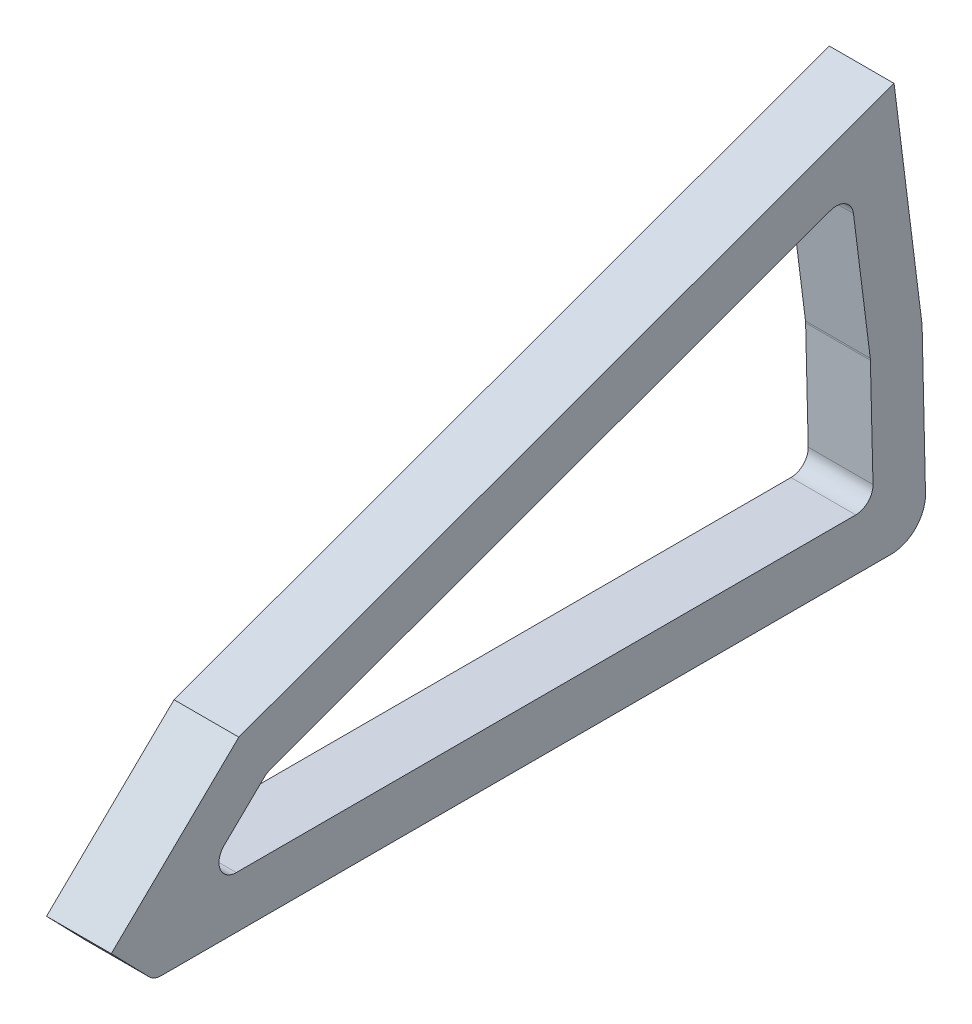
ISO-10303-21;
HEADER;
FILE_DESCRIPTION(('STEP AP214'),'2;1');
FILE_NAME('part.step','',(''),(''),'','','');
FILE_SCHEMA(('AUTOMOTIVE_DESIGN { 1 0 10303 214 1 1 1 1 }'));
ENDSEC;
DATA;
#1=APPLICATION_CONTEXT('core data for automotive mechanical design processes');
#2=APPLICATION_PROTOCOL_DEFINITION('international standard','automotive_design',2000,#1);
#3=PRODUCT_CONTEXT('',#1,'mechanical');
#4=PRODUCT('Part','Part','',(#3));
#5=PRODUCT_RELATED_PRODUCT_CATEGORY('part','',(#4));
#6=PRODUCT_DEFINITION_FORMATION('','',#4);
#7=PRODUCT_DEFINITION_CONTEXT('part definition',#1,'design');
#8=PRODUCT_DEFINITION('design','',#6,#7);
#9=PRODUCT_DEFINITION_SHAPE('','',#8);
#10=(LENGTH_UNIT() NAMED_UNIT(*) SI_UNIT(.MILLI.,.METRE.));
#11=(NAMED_UNIT(*) PLANE_ANGLE_UNIT() SI_UNIT($,.RADIAN.));
#12=(NAMED_UNIT(*) SI_UNIT($,.STERADIAN.) SOLID_ANGLE_UNIT());
#13=UNCERTAINTY_MEASURE_WITH_UNIT(LENGTH_MEASURE(1.E-05),#10,'distance_accuracy_value','');
#14=(GEOMETRIC_REPRESENTATION_CONTEXT(3) GLOBAL_UNCERTAINTY_ASSIGNED_CONTEXT((#13)) GLOBAL_UNIT_ASSIGNED_CONTEXT((#10,
#11,#12)) REPRESENTATION_CONTEXT('',''));
#15=CARTESIAN_POINT('',(0.,0.,0.));
#16=DIRECTION('',(0.,0.,1.));
#17=DIRECTION('',(1.,0.,0.));
#18=AXIS2_PLACEMENT_3D('',#15,#16,#17);
#19=CARTESIAN_POINT('',(15.,-10.8584886774871,98.699643505515));
#20=DIRECTION('',(1.,0.,0.));
#21=DIRECTION('',(0.,0.,-1.));
#22=AXIS2_PLACEMENT_3D('',#19,#20,#21);
#23=PLANE('',#22);
#24=DIRECTION('',(0.,-0.696465559145117,0.717590220756024));
#25=VECTOR('',#24,1.);
#26=CARTESIAN_POINT('',(15.,24.0120476827421,80.7643565809834));
#27=LINE('',#26,#25);
#28=CARTESIAN_POINT('',(15.,24.0120476827421,80.7643565809834));
#29=VERTEX_POINT('',#28);
#30=CARTESIAN_POINT('',(15.,-4.65190763436072,110.297725106755));
#31=VERTEX_POINT('',#30);
#32=EDGE_CURVE('E239',#29,#31,#27,.T.);
#33=ORIENTED_EDGE('',*,*,#32,.T.);
#34=DIRECTION('',(0.,-0.717590220756024,-0.696465559145117));
#35=VECTOR('',#34,1.);
#36=CARTESIAN_POINT('',(15.,-4.65190763436072,110.297725106755));
#37=LINE('',#36,#35);
#38=CARTESIAN_POINT('',(15.,-13.6443509140675,101.570004388539));
#39=VERTEX_POINT('',#38);
#40=EDGE_CURVE('E242',#31,#39,#37,.T.);
#41=ORIENTED_EDGE('',*,*,#40,.T.);
#42=CARTESIAN_POINT('',(15.,-10.8584886774871,98.699643505515));
#43=DIRECTION('',(1.,0.,0.));
#44=DIRECTION('',(0.,0.,-1.));
#45=AXIS2_PLACEMENT_3D('',#42,#43,#44);
#46=CIRCLE('',#45,4.);
#47=CARTESIAN_POINT('',(15.,-14.8584886774871,98.699643505515));
#48=VERTEX_POINT('',#47);
#49=EDGE_CURVE('E245',#39,#48,#46,.T.);
#50=ORIENTED_EDGE('',*,*,#49,.T.);
#51=DIRECTION('',(0.,0.,-1.));
#52=VECTOR('',#51,1.);
#53=CARTESIAN_POINT('',(15.,-14.8584886774871,-70.2619743209976));
#54=LINE('',#53,#52);
#55=CARTESIAN_POINT('',(15.,-14.8584886774871,-70.2619743209976));
#56=VERTEX_POINT('',#55);
#57=EDGE_CURVE('E247',#48,#56,#54,.T.);
#58=ORIENTED_EDGE('',*,*,#57,.T.);
#59=CARTESIAN_POINT('',(15.,-6.85848867748714,-70.2619743209977));
#60=DIRECTION('',(1.,0.,0.));
#61=DIRECTION('',(0.,0.,1.));
#62=AXIS2_PLACEMENT_3D('',#59,#60,#61);
#63=CIRCLE('',#62,8.);
#64=CARTESIAN_POINT('',(15.,-6.67527630251636,-78.2598761224489));
#65=VERTEX_POINT('',#64);
#66=EDGE_CURVE('E249',#56,#65,#63,.T.);
#67=ORIENTED_EDGE('',*,*,#66,.T.);
#68=DIRECTION('',(0.,0.99973772518141,0.0229015468713474));
#69=VECTOR('',#68,1.);
#70=CARTESIAN_POINT('',(15.,27.5551896385567,-77.475739843071));
#71=LINE('',#70,#69);
#72=CARTESIAN_POINT('',(15.,27.5551896385567,-77.475739843071));
#73=VERTEX_POINT('',#72);
#74=EDGE_CURVE('E251',#65,#73,#71,.T.);
#75=ORIENTED_EDGE('',*,*,#74,.T.);
#76=DIRECTION('',(0.,0.992208417106749,0.124589152908747));
#77=VECTOR('',#76,1.);
#78=CARTESIAN_POINT('',(15.,79.2443893893612,-70.9852550815505));
#79=LINE('',#78,#77);
#80=CARTESIAN_POINT('',(15.,79.2443893893612,-70.9852550815505));
#81=VERTEX_POINT('',#80);
#82=EDGE_CURVE('E253',#73,#81,#79,.T.);
#83=ORIENTED_EDGE('',*,*,#82,.T.);
#84=DIRECTION('',(0.,-0.342020143325676,0.939692620785906));
#85=VECTOR('',#84,1.);
#86=CARTESIAN_POINT('',(15.,24.0120476827421,80.7643565809834));
#87=LINE('',#86,#85);
#88=EDGE_CURVE('E255',#81,#29,#87,.T.);
#89=ORIENTED_EDGE('',*,*,#88,.T.);
#90=EDGE_LOOP('',(#33,#41,#50,#58,#67,#75,#83,#89));
#91=FACE_BOUND('',#90,.T.);
#92=DIRECTION('',(0.,-0.696465559145117,0.717590220756024));
#93=VECTOR('',#92,1.);
#94=CARTESIAN_POINT('',(15.,13.0176999105198,74.862322372561));
#95=LINE('',#94,#93);
#96=CARTESIAN_POINT('',(15.,13.0176999105198,74.862322372561));
#97=VERTEX_POINT('',#96);
#98=CARTESIAN_POINT('',(15.,4.01187220553716,84.141307967831));
#99=VERTEX_POINT('',#98);
#100=EDGE_CURVE('E168',#97,#99,#95,.T.);
#101=ORIENTED_EDGE('',*,*,#100,.F.);
#102=CARTESIAN_POINT('',(15.,10.1473390274957,72.0764601359805));
#103=DIRECTION('',(1.,0.,0.));
#104=DIRECTION('',(0.,0.,-1.));
#105=AXIS2_PLACEMENT_3D('',#102,#103,#104);
#106=CIRCLE('',#105,4.);
#107=CARTESIAN_POINT('',(15.,13.9061095106393,73.4445407092832));
#108=VERTEX_POINT('',#107);
#109=EDGE_CURVE('E160',#108,#97,#106,.T.);
#110=ORIENTED_EDGE('',*,*,#109,.F.);
#111=DIRECTION('',(0.,-0.342020143325677,0.939692620785906));
#112=VECTOR('',#111,1.);
#113=CARTESIAN_POINT('',(15.,13.9061095106393,73.4445407092832));
#114=LINE('',#113,#112);
#115=CARTESIAN_POINT('',(15.,61.1077436976681,-56.2408833809324));
#116=VERTEX_POINT('',#115);
#117=EDGE_CURVE('E197',#116,#108,#114,.T.);
#118=ORIENTED_EDGE('',*,*,#117,.F.);
#119=CARTESIAN_POINT('',(15.,57.3489732145245,-57.6089639542351));
#120=DIRECTION('',(1.,0.,0.));
#121=DIRECTION('',(0.,0.,1.));
#122=AXIS2_PLACEMENT_3D('',#119,#120,#121);
#123=CIRCLE('',#122,4.);
#124=CARTESIAN_POINT('',(15.,57.8473298261595,-61.5777976226621));
#125=VERTEX_POINT('',#124);
#126=EDGE_CURVE('E195',#125,#116,#123,.T.);
#127=ORIENTED_EDGE('',*,*,#126,.F.);
#128=DIRECTION('',(0.,0.992208417106749,0.124589152908746));
#129=VECTOR('',#128,1.);
#130=CARTESIAN_POINT('',(15.,57.8473298261595,-61.5777976226621));
#131=LINE('',#130,#129);
#132=CARTESIAN_POINT('',(15.,26.8615184457951,-65.4686091956247));
#133=VERTEX_POINT('',#132);
#134=EDGE_CURVE('E193',#133,#125,#131,.T.);
#135=ORIENTED_EDGE('',*,*,#134,.F.);
#136=CARTESIAN_POINT('',(15.,26.3631618341601,-61.4997755271977));
#137=DIRECTION('',(1.,0.,0.));
#138=DIRECTION('',(0.,0.,-1.));
#139=AXIS2_PLACEMENT_3D('',#136,#137,#138);
#140=CIRCLE('',#139,3.99999999999999);
#141=CARTESIAN_POINT('',(15.,26.4593041600422,-65.4986199419222));
#142=VERTEX_POINT('',#141);
#143=EDGE_CURVE('E191',#142,#133,#140,.T.);
#144=ORIENTED_EDGE('',*,*,#143,.F.);
#145=DIRECTION('',(0.,0.999711103681145,0.0240355814705314));
#146=VECTOR('',#145,1.);
#147=CARTESIAN_POINT('',(15.,1.23765364839515,-66.1050121620964));
#148=LINE('',#147,#146);
#149=CARTESIAN_POINT('',(15.,1.23765364839515,-66.1050121620964));
#150=VERTEX_POINT('',#149);
#151=EDGE_CURVE('E189',#150,#142,#148,.T.);
#152=ORIENTED_EDGE('',*,*,#151,.F.);
#153=CARTESIAN_POINT('',(15.,1.141511322513,-62.1061677473718));
#154=DIRECTION('',(1.,0.,0.));
#155=DIRECTION('',(0.,0.,-1.));
#156=AXIS2_PLACEMENT_3D('',#153,#154,#155);
#157=CIRCLE('',#156,4.);
#158=CARTESIAN_POINT('',(15.,-2.858488677487,-62.1061677473718));
#159=VERTEX_POINT('',#158);
#160=EDGE_CURVE('E187',#159,#150,#157,.T.);
#161=ORIENTED_EDGE('',*,*,#160,.F.);
#162=DIRECTION('',(0.,0.,-1.));
#163=VECTOR('',#162,1.);
#164=CARTESIAN_POINT('',(15.,-2.858488677487,-62.1061677473718));
#165=LINE('',#164,#163);
#166=CARTESIAN_POINT('',(15.,-2.85848867748701,81.3554457312505));
#167=VERTEX_POINT('',#166);
#168=EDGE_CURVE('E183',#167,#159,#165,.T.);
#169=ORIENTED_EDGE('',*,*,#168,.F.);
#170=CARTESIAN_POINT('',(15.,1.14151132251299,81.3554457312506));
#171=DIRECTION('',(1.,0.,0.));
#172=DIRECTION('',(0.,0.,1.));
#173=AXIS2_PLACEMENT_3D('',#170,#171,#172);
#174=CIRCLE('',#173,4.);
#175=EDGE_CURVE('E181',#99,#167,#174,.T.);
#176=ORIENTED_EDGE('',*,*,#175,.F.);
#177=EDGE_LOOP('',(#101,#110,#118,#127,#135,#144,#152,#161,#169,#176));
#178=FACE_BOUND('',#177,.T.);
#179=ADVANCED_FACE('F35',(#91,#178),#23,.T.);
#180=CARTESIAN_POINT('',(0.,-10.8584886774871,98.699643505515));
#181=DIRECTION('',(1.,0.,0.));
#182=DIRECTION('',(0.,0.,-1.));
#183=AXIS2_PLACEMENT_3D('',#180,#181,#182);
#184=PLANE('',#183);
#185=DIRECTION('',(0.,-0.696465559145117,0.717590220756024));
#186=VECTOR('',#185,1.);
#187=CARTESIAN_POINT('',(0.,24.0120476827421,80.7643565809834));
#188=LINE('',#187,#186);
#189=CARTESIAN_POINT('',(0.,24.0120476827421,80.7643565809834));
#190=VERTEX_POINT('',#189);
#191=CARTESIAN_POINT('',(0.,-4.65190763436072,110.297725106755));
#192=VERTEX_POINT('',#191);
#193=EDGE_CURVE('E176',#190,#192,#188,.T.);
#194=ORIENTED_EDGE('',*,*,#193,.F.);
#195=DIRECTION('',(0.,-0.342020143325676,0.939692620785906));
#196=VECTOR('',#195,1.);
#197=CARTESIAN_POINT('',(0.,24.0120476827421,80.7643565809834));
#198=LINE('',#197,#196);
#199=CARTESIAN_POINT('',(0.,79.2443893893612,-70.9852550815505));
#200=VERTEX_POINT('',#199);
#201=EDGE_CURVE('E243',#200,#190,#198,.T.);
#202=ORIENTED_EDGE('',*,*,#201,.F.);
#203=DIRECTION('',(0.,0.992208417106749,0.124589152908747));
#204=VECTOR('',#203,1.);
#205=CARTESIAN_POINT('',(0.,79.2443893893612,-70.9852550815505));
#206=LINE('',#205,#204);
#207=CARTESIAN_POINT('',(0.,27.5551896385567,-77.475739843071));
#208=VERTEX_POINT('',#207);
#209=EDGE_CURVE('E270',#208,#200,#206,.T.);
#210=ORIENTED_EDGE('',*,*,#209,.F.);
#211=DIRECTION('',(0.,0.99973772518141,0.0229015468713474));
#212=VECTOR('',#211,1.);
#213=CARTESIAN_POINT('',(0.,27.5551896385567,-77.475739843071));
#214=LINE('',#213,#212);
#215=CARTESIAN_POINT('',(0.,-6.67527630251636,-78.2598761224489));
#216=VERTEX_POINT('',#215);
#217=EDGE_CURVE('E268',#216,#208,#214,.T.);
#218=ORIENTED_EDGE('',*,*,#217,.F.);
#219=CARTESIAN_POINT('',(0.,-6.85848867748714,-70.2619743209977));
#220=DIRECTION('',(1.,0.,0.));
#221=DIRECTION('',(0.,0.,1.));
#222=AXIS2_PLACEMENT_3D('',#219,#220,#221);
#223=CIRCLE('',#222,8.);
#224=CARTESIAN_POINT('',(0.,-14.8584886774871,-70.2619743209976));
#225=VERTEX_POINT('',#224);
#226=EDGE_CURVE('E266',#225,#216,#223,.T.);
#227=ORIENTED_EDGE('',*,*,#226,.F.);
#228=DIRECTION('',(0.,0.,-1.));
#229=VECTOR('',#228,1.);
#230=CARTESIAN_POINT('',(0.,-14.8584886774871,-70.2619743209976));
#231=LINE('',#230,#229);
#232=CARTESIAN_POINT('',(0.,-14.8584886774871,98.699643505515));
#233=VERTEX_POINT('',#232);
#234=EDGE_CURVE('E264',#233,#225,#231,.T.);
#235=ORIENTED_EDGE('',*,*,#234,.F.);
#236=CARTESIAN_POINT('',(0.,-10.8584886774871,98.699643505515));
#237=DIRECTION('',(1.,0.,0.));
#238=DIRECTION('',(0.,0.,-1.));
#239=AXIS2_PLACEMENT_3D('',#236,#237,#238);
#240=CIRCLE('',#239,4.);
#241=CARTESIAN_POINT('',(0.,-13.6443509140675,101.570004388539));
#242=VERTEX_POINT('',#241);
#243=EDGE_CURVE('E262',#242,#233,#240,.T.);
#244=ORIENTED_EDGE('',*,*,#243,.F.);
#245=DIRECTION('',(0.,-0.717590220756024,-0.696465559145117));
#246=VECTOR('',#245,1.);
#247=CARTESIAN_POINT('',(0.,-4.65190763436072,110.297725106755));
#248=LINE('',#247,#246);
#249=EDGE_CURVE('E260',#192,#242,#248,.T.);
#250=ORIENTED_EDGE('',*,*,#249,.F.);
#251=EDGE_LOOP('',(#194,#202,#210,#218,#227,#235,#244,#250));
#252=FACE_BOUND('',#251,.T.);
#253=CARTESIAN_POINT('',(0.,10.1473390274957,72.0764601359805));
#254=DIRECTION('',(1.,0.,0.));
#255=DIRECTION('',(0.,0.,-1.));
#256=AXIS2_PLACEMENT_3D('',#253,#254,#255);
#257=CIRCLE('',#256,4.);
#258=CARTESIAN_POINT('',(0.,13.9061095106393,73.4445407092832));
#259=VERTEX_POINT('',#258);
#260=CARTESIAN_POINT('',(0.,13.0176999105198,74.862322372561));
#261=VERTEX_POINT('',#260);
#262=EDGE_CURVE('E58',#259,#261,#257,.T.);
#263=ORIENTED_EDGE('',*,*,#262,.T.);
#264=DIRECTION('',(0.,-0.696465559145117,0.717590220756024));
#265=VECTOR('',#264,1.);
#266=CARTESIAN_POINT('',(0.,13.0176999105198,74.862322372561));
#267=LINE('',#266,#265);
#268=CARTESIAN_POINT('',(0.,4.01187220553716,84.141307967831));
#269=VERTEX_POINT('',#268);
#270=EDGE_CURVE('E175',#261,#269,#267,.T.);
#271=ORIENTED_EDGE('',*,*,#270,.T.);
#272=CARTESIAN_POINT('',(0.,1.14151132251299,81.3554457312506));
#273=DIRECTION('',(1.,0.,0.));
#274=DIRECTION('',(0.,0.,1.));
#275=AXIS2_PLACEMENT_3D('',#272,#273,#274);
#276=CIRCLE('',#275,4.);
#277=CARTESIAN_POINT('',(0.,-2.85848867748701,81.3554457312505));
#278=VERTEX_POINT('',#277);
#279=EDGE_CURVE('E201',#269,#278,#276,.T.);
#280=ORIENTED_EDGE('',*,*,#279,.T.);
#281=DIRECTION('',(0.,0.,-1.));
#282=VECTOR('',#281,1.);
#283=CARTESIAN_POINT('',(0.,-2.858488677487,-62.1061677473718));
#284=LINE('',#283,#282);
#285=CARTESIAN_POINT('',(0.,-2.858488677487,-62.1061677473718));
#286=VERTEX_POINT('',#285);
#287=EDGE_CURVE('E204',#278,#286,#284,.T.);
#288=ORIENTED_EDGE('',*,*,#287,.T.);
#289=CARTESIAN_POINT('',(0.,1.141511322513,-62.1061677473718));
#290=DIRECTION('',(1.,0.,0.));
#291=DIRECTION('',(0.,0.,-1.));
#292=AXIS2_PLACEMENT_3D('',#289,#290,#291);
#293=CIRCLE('',#292,4.);
#294=CARTESIAN_POINT('',(0.,1.23765364839515,-66.1050121620964));
#295=VERTEX_POINT('',#294);
#296=EDGE_CURVE('E207',#286,#295,#293,.T.);
#297=ORIENTED_EDGE('',*,*,#296,.T.);
#298=DIRECTION('',(0.,0.999711103681145,0.0240355814705314));
#299=VECTOR('',#298,1.);
#300=CARTESIAN_POINT('',(0.,1.23765364839515,-66.1050121620964));
#301=LINE('',#300,#299);
#302=CARTESIAN_POINT('',(0.,26.4593041600422,-65.4986199419222));
#303=VERTEX_POINT('',#302);
#304=EDGE_CURVE('E210',#295,#303,#301,.T.);
#305=ORIENTED_EDGE('',*,*,#304,.T.);
#306=CARTESIAN_POINT('',(0.,26.3631618341601,-61.4997755271977));
#307=DIRECTION('',(1.,0.,0.));
#308=DIRECTION('',(0.,0.,-1.));
#309=AXIS2_PLACEMENT_3D('',#306,#307,#308);
#310=CIRCLE('',#309,3.99999999999999);
#311=CARTESIAN_POINT('',(0.,26.8615184457951,-65.4686091956247));
#312=VERTEX_POINT('',#311);
#313=EDGE_CURVE('E213',#303,#312,#310,.T.);
#314=ORIENTED_EDGE('',*,*,#313,.T.);
#315=DIRECTION('',(0.,0.992208417106749,0.124589152908746));
#316=VECTOR('',#315,1.);
#317=CARTESIAN_POINT('',(0.,57.8473298261595,-61.5777976226621));
#318=LINE('',#317,#316);
#319=CARTESIAN_POINT('',(0.,57.8473298261595,-61.5777976226621));
#320=VERTEX_POINT('',#319);
#321=EDGE_CURVE('E216',#312,#320,#318,.T.);
#322=ORIENTED_EDGE('',*,*,#321,.T.);
#323=CARTESIAN_POINT('',(0.,57.3489732145245,-57.6089639542351));
#324=DIRECTION('',(1.,0.,0.));
#325=DIRECTION('',(0.,0.,1.));
#326=AXIS2_PLACEMENT_3D('',#323,#324,#325);
#327=CIRCLE('',#326,4.);
#328=CARTESIAN_POINT('',(0.,61.1077436976681,-56.2408833809324));
#329=VERTEX_POINT('',#328);
#330=EDGE_CURVE('E219',#320,#329,#327,.T.);
#331=ORIENTED_EDGE('',*,*,#330,.T.);
#332=DIRECTION('',(0.,-0.342020143325677,0.939692620785906));
#333=VECTOR('',#332,1.);
#334=CARTESIAN_POINT('',(0.,13.9061095106393,73.4445407092832));
#335=LINE('',#334,#333);
#336=EDGE_CURVE('E169',#329,#259,#335,.T.);
#337=ORIENTED_EDGE('',*,*,#336,.T.);
#338=EDGE_LOOP('',(#263,#271,#280,#288,#297,#305,#314,#322,#331,#337));
#339=FACE_BOUND('',#338,.T.);
#340=ADVANCED_FACE('F300',(#252,#339),#184,.F.);
#341=CARTESIAN_POINT('',(15.,24.0120476827421,80.7643565809834));
#342=DIRECTION('',(0.,-0.717590220756024,-0.696465559145117));
#343=DIRECTION('',(0.,0.696465559145117,-0.717590220756024));
#344=AXIS2_PLACEMENT_3D('',#341,#342,#343);
#345=PLANE('',#344);
#346=ORIENTED_EDGE('',*,*,#193,.T.);
#347=DIRECTION('',(-1.,0.,0.));
#348=VECTOR('',#347,1.);
#349=CARTESIAN_POINT('',(15.,-4.65190763436072,110.297725106755));
#350=LINE('',#349,#348);
#351=EDGE_CURVE('E11',#31,#192,#350,.T.);
#352=ORIENTED_EDGE('',*,*,#351,.F.);
#353=ORIENTED_EDGE('',*,*,#32,.F.);
#354=DIRECTION('',(-1.,0.,0.));
#355=VECTOR('',#354,1.);
#356=CARTESIAN_POINT('',(15.,24.0120476827421,80.7643565809834));
#357=LINE('',#356,#355);
#358=EDGE_CURVE('E257',#29,#190,#357,.T.);
#359=ORIENTED_EDGE('',*,*,#358,.T.);
#360=EDGE_LOOP('',(#346,#352,#353,#359));
#361=FACE_BOUND('',#360,.T.);
#362=ADVANCED_FACE('F37',(#361),#345,.F.);
#363=CARTESIAN_POINT('',(15.,-4.65190763436072,110.297725106755));
#364=DIRECTION('',(0.,0.696465559145117,-0.717590220756024));
#365=DIRECTION('',(0.,0.717590220756024,0.696465559145117));
#366=AXIS2_PLACEMENT_3D('',#363,#364,#365);
#367=PLANE('',#366);
#368=ORIENTED_EDGE('',*,*,#249,.T.);
#369=DIRECTION('',(-1.,0.,0.));
#370=VECTOR('',#369,1.);
#371=CARTESIAN_POINT('',(15.,-13.6443509140675,101.570004388539));
#372=LINE('',#371,#370);
#373=EDGE_CURVE('E43',#39,#242,#372,.T.);
#374=ORIENTED_EDGE('',*,*,#373,.F.);
#375=ORIENTED_EDGE('',*,*,#40,.F.);
#376=ORIENTED_EDGE('',*,*,#351,.T.);
#377=EDGE_LOOP('',(#368,#374,#375,#376));
#378=FACE_BOUND('',#377,.T.);
#379=ADVANCED_FACE('F317',(#378),#367,.F.);
#380=CARTESIAN_POINT('',(15.,-10.8584886774871,98.699643505515));
#381=DIRECTION('',(-1.,0.,0.));
#382=DIRECTION('',(0.,0.,1.));
#383=AXIS2_PLACEMENT_3D('',#380,#381,#382);
#384=CYLINDRICAL_SURFACE('',#383,4.);
#385=ORIENTED_EDGE('',*,*,#243,.T.);
#386=DIRECTION('',(-1.,0.,0.));
#387=VECTOR('',#386,1.);
#388=CARTESIAN_POINT('',(15.,-14.8584886774871,98.699643505515));
#389=LINE('',#388,#387);
#390=EDGE_CURVE('E287',#48,#233,#389,.T.);
#391=ORIENTED_EDGE('',*,*,#390,.F.);
#392=ORIENTED_EDGE('',*,*,#49,.F.);
#393=ORIENTED_EDGE('',*,*,#373,.T.);
#394=EDGE_LOOP('',(#385,#391,#392,#393));
#395=FACE_BOUND('',#394,.T.);
#396=ADVANCED_FACE('F294',(#395),#384,.T.);
#397=CARTESIAN_POINT('',(15.,-14.8584886774871,-70.2619743209976));
#398=DIRECTION('',(0.,1.,0.));
#399=DIRECTION('',(0.,0.,1.));
#400=AXIS2_PLACEMENT_3D('',#397,#398,#399);
#401=PLANE('',#400);
#402=ORIENTED_EDGE('',*,*,#234,.T.);
#403=DIRECTION('',(-1.,0.,0.));
#404=VECTOR('',#403,1.);
#405=CARTESIAN_POINT('',(15.,-14.8584886774871,-70.2619743209976));
#406=LINE('',#405,#404);
#407=EDGE_CURVE('E284',#56,#225,#406,.T.);
#408=ORIENTED_EDGE('',*,*,#407,.F.);
#409=ORIENTED_EDGE('',*,*,#57,.F.);
#410=ORIENTED_EDGE('',*,*,#390,.T.);
#411=EDGE_LOOP('',(#402,#408,#409,#410));
#412=FACE_BOUND('',#411,.T.);
#413=ADVANCED_FACE('F306',(#412),#401,.F.);
#414=CARTESIAN_POINT('',(15.,-6.85848867748714,-70.2619743209977));
#415=DIRECTION('',(-1.,0.,0.));
#416=DIRECTION('',(0.,0.,1.));
#417=AXIS2_PLACEMENT_3D('',#414,#415,#416);
#418=CYLINDRICAL_SURFACE('',#417,8.);
#419=ORIENTED_EDGE('',*,*,#226,.T.);
#420=DIRECTION('',(-1.,0.,0.));
#421=VECTOR('',#420,1.);
#422=CARTESIAN_POINT('',(15.,-6.67527630251636,-78.2598761224489));
#423=LINE('',#422,#421);
#424=EDGE_CURVE('E281',#65,#216,#423,.T.);
#425=ORIENTED_EDGE('',*,*,#424,.F.);
#426=ORIENTED_EDGE('',*,*,#66,.F.);
#427=ORIENTED_EDGE('',*,*,#407,.T.);
#428=EDGE_LOOP('',(#419,#425,#426,#427));
#429=FACE_BOUND('',#428,.T.);
#430=ADVANCED_FACE('F310',(#429),#418,.T.);
#431=CARTESIAN_POINT('',(15.,27.5551896385567,-77.475739843071));
#432=DIRECTION('',(0.,-0.0229015468713474,0.999737725181409));
#433=DIRECTION('',(0.,-0.99973772518141,-0.0229015468713474));
#434=AXIS2_PLACEMENT_3D('',#431,#432,#433);
#435=PLANE('',#434);
#436=ORIENTED_EDGE('',*,*,#217,.T.);
#437=DIRECTION('',(-1.,0.,0.));
#438=VECTOR('',#437,1.);
#439=CARTESIAN_POINT('',(15.,27.5551896385567,-77.475739843071));
#440=LINE('',#439,#438);
#441=EDGE_CURVE('E278',#73,#208,#440,.T.);
#442=ORIENTED_EDGE('',*,*,#441,.F.);
#443=ORIENTED_EDGE('',*,*,#74,.F.);
#444=ORIENTED_EDGE('',*,*,#424,.T.);
#445=EDGE_LOOP('',(#436,#442,#443,#444));
#446=FACE_BOUND('',#445,.T.);
#447=ADVANCED_FACE('F330',(#446),#435,.F.);
#448=CARTESIAN_POINT('',(15.,79.2443893893612,-70.9852550815505));
#449=DIRECTION('',(0.,-0.124589152908747,0.992208417106749));
#450=DIRECTION('',(0.,-0.992208417106749,-0.124589152908747));
#451=AXIS2_PLACEMENT_3D('',#448,#449,#450);
#452=PLANE('',#451);
#453=ORIENTED_EDGE('',*,*,#209,.T.);
#454=DIRECTION('',(-1.,0.,0.));
#455=VECTOR('',#454,1.);
#456=CARTESIAN_POINT('',(15.,79.2443893893612,-70.9852550815505));
#457=LINE('',#456,#455);
#458=EDGE_CURVE('E275',#81,#200,#457,.T.);
#459=ORIENTED_EDGE('',*,*,#458,.F.);
#460=ORIENTED_EDGE('',*,*,#82,.F.);
#461=ORIENTED_EDGE('',*,*,#441,.T.);
#462=EDGE_LOOP('',(#453,#459,#460,#461));
#463=FACE_BOUND('',#462,.T.);
#464=ADVANCED_FACE('F328',(#463),#452,.F.);
#465=CARTESIAN_POINT('',(15.,24.0120476827421,80.7643565809834));
#466=DIRECTION('',(0.,-0.939692620785906,-0.342020143325677));
#467=DIRECTION('',(0.,0.342020143325677,-0.939692620785906));
#468=AXIS2_PLACEMENT_3D('',#465,#466,#467);
#469=PLANE('',#468);
#470=ORIENTED_EDGE('',*,*,#201,.T.);
#471=ORIENTED_EDGE('',*,*,#358,.F.);
#472=ORIENTED_EDGE('',*,*,#88,.F.);
#473=ORIENTED_EDGE('',*,*,#458,.T.);
#474=EDGE_LOOP('',(#470,#471,#472,#473));
#475=FACE_BOUND('',#474,.T.);
#476=ADVANCED_FACE('F323',(#475),#469,.F.);
#477=CARTESIAN_POINT('',(15.,10.1473390274957,72.0764601359805));
#478=DIRECTION('',(-1.,0.,0.));
#479=DIRECTION('',(0.,0.,1.));
#480=AXIS2_PLACEMENT_3D('',#477,#478,#479);
#481=CYLINDRICAL_SURFACE('',#480,4.);
#482=ORIENTED_EDGE('',*,*,#262,.F.);
#483=DIRECTION('',(-1.,0.,0.));
#484=VECTOR('',#483,1.);
#485=CARTESIAN_POINT('',(15.,13.9061095106393,73.4445407092832));
#486=LINE('',#485,#484);
#487=EDGE_CURVE('E164',#108,#259,#486,.T.);
#488=ORIENTED_EDGE('',*,*,#487,.F.);
#489=ORIENTED_EDGE('',*,*,#109,.T.);
#490=DIRECTION('',(-1.,0.,0.));
#491=VECTOR('',#490,1.);
#492=CARTESIAN_POINT('',(15.,13.0176999105198,74.862322372561));
#493=LINE('',#492,#491);
#494=EDGE_CURVE('E163',#97,#261,#493,.T.);
#495=ORIENTED_EDGE('',*,*,#494,.T.);
#496=EDGE_LOOP('',(#482,#488,#489,#495));
#497=FACE_BOUND('',#496,.T.);
#498=ADVANCED_FACE('F162',(#497),#481,.F.);
#499=CARTESIAN_POINT('',(15.,13.0176999105198,74.862322372561));
#500=DIRECTION('',(0.,-0.717590220756024,-0.696465559145117));
#501=DIRECTION('',(0.,0.696465559145117,-0.717590220756024));
#502=AXIS2_PLACEMENT_3D('',#499,#500,#501);
#503=PLANE('',#502);
#504=ORIENTED_EDGE('',*,*,#270,.F.);
#505=ORIENTED_EDGE('',*,*,#494,.F.);
#506=ORIENTED_EDGE('',*,*,#100,.T.);
#507=DIRECTION('',(-1.,0.,0.));
#508=VECTOR('',#507,1.);
#509=CARTESIAN_POINT('',(15.,4.01187220553716,84.141307967831));
#510=LINE('',#509,#508);
#511=EDGE_CURVE('E177',#99,#269,#510,.T.);
#512=ORIENTED_EDGE('',*,*,#511,.T.);
#513=EDGE_LOOP('',(#504,#505,#506,#512));
#514=FACE_BOUND('',#513,.T.);
#515=ADVANCED_FACE('F172',(#514),#503,.T.);
#516=CARTESIAN_POINT('',(15.,1.14151132251299,81.3554457312506));
#517=DIRECTION('',(-1.,0.,0.));
#518=DIRECTION('',(0.,0.,1.));
#519=AXIS2_PLACEMENT_3D('',#516,#517,#518);
#520=CYLINDRICAL_SURFACE('',#519,4.);
#521=ORIENTED_EDGE('',*,*,#279,.F.);
#522=ORIENTED_EDGE('',*,*,#511,.F.);
#523=ORIENTED_EDGE('',*,*,#175,.T.);
#524=DIRECTION('',(-1.,0.,0.));
#525=VECTOR('',#524,1.);
#526=CARTESIAN_POINT('',(15.,-2.85848867748701,81.3554457312505));
#527=LINE('',#526,#525);
#528=EDGE_CURVE('E236',#167,#278,#527,.T.);
#529=ORIENTED_EDGE('',*,*,#528,.T.);
#530=EDGE_LOOP('',(#521,#522,#523,#529));
#531=FACE_BOUND('',#530,.T.);
#532=ADVANCED_FACE('F355',(#531),#520,.F.);
#533=CARTESIAN_POINT('',(15.,-2.858488677487,-62.1061677473718));
#534=DIRECTION('',(0.,1.,0.));
#535=DIRECTION('',(0.,0.,1.));
#536=AXIS2_PLACEMENT_3D('',#533,#534,#535);
#537=PLANE('',#536);
#538=ORIENTED_EDGE('',*,*,#287,.F.);
#539=ORIENTED_EDGE('',*,*,#528,.F.);
#540=ORIENTED_EDGE('',*,*,#168,.T.);
#541=DIRECTION('',(-1.,0.,0.));
#542=VECTOR('',#541,1.);
#543=CARTESIAN_POINT('',(15.,-2.858488677487,-62.1061677473718));
#544=LINE('',#543,#542);
#545=EDGE_CURVE('E234',#159,#286,#544,.T.);
#546=ORIENTED_EDGE('',*,*,#545,.T.);
#547=EDGE_LOOP('',(#538,#539,#540,#546));
#548=FACE_BOUND('',#547,.T.);
#549=ADVANCED_FACE('F359',(#548),#537,.T.);
#550=CARTESIAN_POINT('',(15.,1.141511322513,-62.1061677473718));
#551=DIRECTION('',(-1.,0.,0.));
#552=DIRECTION('',(0.,0.,1.));
#553=AXIS2_PLACEMENT_3D('',#550,#551,#552);
#554=CYLINDRICAL_SURFACE('',#553,4.);
#555=ORIENTED_EDGE('',*,*,#296,.F.);
#556=ORIENTED_EDGE('',*,*,#545,.F.);
#557=ORIENTED_EDGE('',*,*,#160,.T.);
#558=DIRECTION('',(-1.,0.,0.));
#559=VECTOR('',#558,1.);
#560=CARTESIAN_POINT('',(15.,1.23765364839515,-66.1050121620964));
#561=LINE('',#560,#559);
#562=EDGE_CURVE('E232',#150,#295,#561,.T.);
#563=ORIENTED_EDGE('',*,*,#562,.T.);
#564=EDGE_LOOP('',(#555,#556,#557,#563));
#565=FACE_BOUND('',#564,.T.);
#566=ADVANCED_FACE('F365',(#565),#554,.F.);
#567=CARTESIAN_POINT('',(15.,1.23765364839515,-66.1050121620964));
#568=DIRECTION('',(0.,-0.0240355814705314,0.999711103681145));
#569=DIRECTION('',(0.,-0.999711103681145,-0.0240355814705314));
#570=AXIS2_PLACEMENT_3D('',#567,#568,#569);
#571=PLANE('',#570);
#572=ORIENTED_EDGE('',*,*,#304,.F.);
#573=ORIENTED_EDGE('',*,*,#562,.F.);
#574=ORIENTED_EDGE('',*,*,#151,.T.);
#575=DIRECTION('',(-1.,0.,0.));
#576=VECTOR('',#575,1.);
#577=CARTESIAN_POINT('',(15.,26.4593041600422,-65.4986199419222));
#578=LINE('',#577,#576);
#579=EDGE_CURVE('E230',#142,#303,#578,.T.);
#580=ORIENTED_EDGE('',*,*,#579,.T.);
#581=EDGE_LOOP('',(#572,#573,#574,#580));
#582=FACE_BOUND('',#581,.T.);
#583=ADVANCED_FACE('F369',(#582),#571,.T.);
#584=CARTESIAN_POINT('',(15.,26.3631618341601,-61.4997755271977));
#585=DIRECTION('',(-1.,0.,0.));
#586=DIRECTION('',(0.,0.,1.));
#587=AXIS2_PLACEMENT_3D('',#584,#585,#586);
#588=CYLINDRICAL_SURFACE('',#587,3.99999999999999);
#589=ORIENTED_EDGE('',*,*,#313,.F.);
#590=ORIENTED_EDGE('',*,*,#579,.F.);
#591=ORIENTED_EDGE('',*,*,#143,.T.);
#592=DIRECTION('',(-1.,0.,0.));
#593=VECTOR('',#592,1.);
#594=CARTESIAN_POINT('',(15.,26.8615184457951,-65.4686091956247));
#595=LINE('',#594,#593);
#596=EDGE_CURVE('E228',#133,#312,#595,.T.);
#597=ORIENTED_EDGE('',*,*,#596,.T.);
#598=EDGE_LOOP('',(#589,#590,#591,#597));
#599=FACE_BOUND('',#598,.T.);
#600=ADVANCED_FACE('F373',(#599),#588,.F.);
#601=CARTESIAN_POINT('',(15.,57.8473298261595,-61.5777976226621));
#602=DIRECTION('',(0.,-0.124589152908746,0.992208417106749));
#603=DIRECTION('',(0.,-0.992208417106749,-0.124589152908746));
#604=AXIS2_PLACEMENT_3D('',#601,#602,#603);
#605=PLANE('',#604);
#606=ORIENTED_EDGE('',*,*,#321,.F.);
#607=ORIENTED_EDGE('',*,*,#596,.F.);
#608=ORIENTED_EDGE('',*,*,#134,.T.);
#609=DIRECTION('',(-1.,0.,0.));
#610=VECTOR('',#609,1.);
#611=CARTESIAN_POINT('',(15.,57.8473298261595,-61.5777976226621));
#612=LINE('',#611,#610);
#613=EDGE_CURVE('E226',#125,#320,#612,.T.);
#614=ORIENTED_EDGE('',*,*,#613,.T.);
#615=EDGE_LOOP('',(#606,#607,#608,#614));
#616=FACE_BOUND('',#615,.T.);
#617=ADVANCED_FACE('F377',(#616),#605,.T.);
#618=CARTESIAN_POINT('',(15.,57.3489732145245,-57.6089639542351));
#619=DIRECTION('',(-1.,0.,0.));
#620=DIRECTION('',(0.,0.,1.));
#621=AXIS2_PLACEMENT_3D('',#618,#619,#620);
#622=CYLINDRICAL_SURFACE('',#621,4.);
#623=ORIENTED_EDGE('',*,*,#330,.F.);
#624=ORIENTED_EDGE('',*,*,#613,.F.);
#625=ORIENTED_EDGE('',*,*,#126,.T.);
#626=DIRECTION('',(-1.,0.,0.));
#627=VECTOR('',#626,1.);
#628=CARTESIAN_POINT('',(15.,61.1077436976681,-56.2408833809324));
#629=LINE('',#628,#627);
#630=EDGE_CURVE('E50',#116,#329,#629,.T.);
#631=ORIENTED_EDGE('',*,*,#630,.T.);
#632=EDGE_LOOP('',(#623,#624,#625,#631));
#633=FACE_BOUND('',#632,.T.);
#634=ADVANCED_FACE('F381',(#633),#622,.F.);
#635=CARTESIAN_POINT('',(15.,13.9061095106393,73.4445407092832));
#636=DIRECTION('',(0.,-0.939692620785906,-0.342020143325677));
#637=DIRECTION('',(0.,0.342020143325677,-0.939692620785906));
#638=AXIS2_PLACEMENT_3D('',#635,#636,#637);
#639=PLANE('',#638);
#640=ORIENTED_EDGE('',*,*,#336,.F.);
#641=ORIENTED_EDGE('',*,*,#630,.F.);
#642=ORIENTED_EDGE('',*,*,#117,.T.);
#643=ORIENTED_EDGE('',*,*,#487,.T.);
#644=EDGE_LOOP('',(#640,#641,#642,#643));
#645=FACE_BOUND('',#644,.T.);
#646=ADVANCED_FACE('F385',(#645),#639,.T.);
#647=CLOSED_SHELL('',(#179,#340,#362,#379,#396,#413,#430,#447,#464,#476,#498,#515,#532,#549,
#566,#583,#600,#617,#634,#646));
#648=MANIFOLD_SOLID_BREP('B2',#647);
#649=ADVANCED_BREP_SHAPE_REPRESENTATION('',(#18,#648),#14);
#650=SHAPE_DEFINITION_REPRESENTATION(#9,#649);
ENDSEC;
END-ISO-10303-21;
